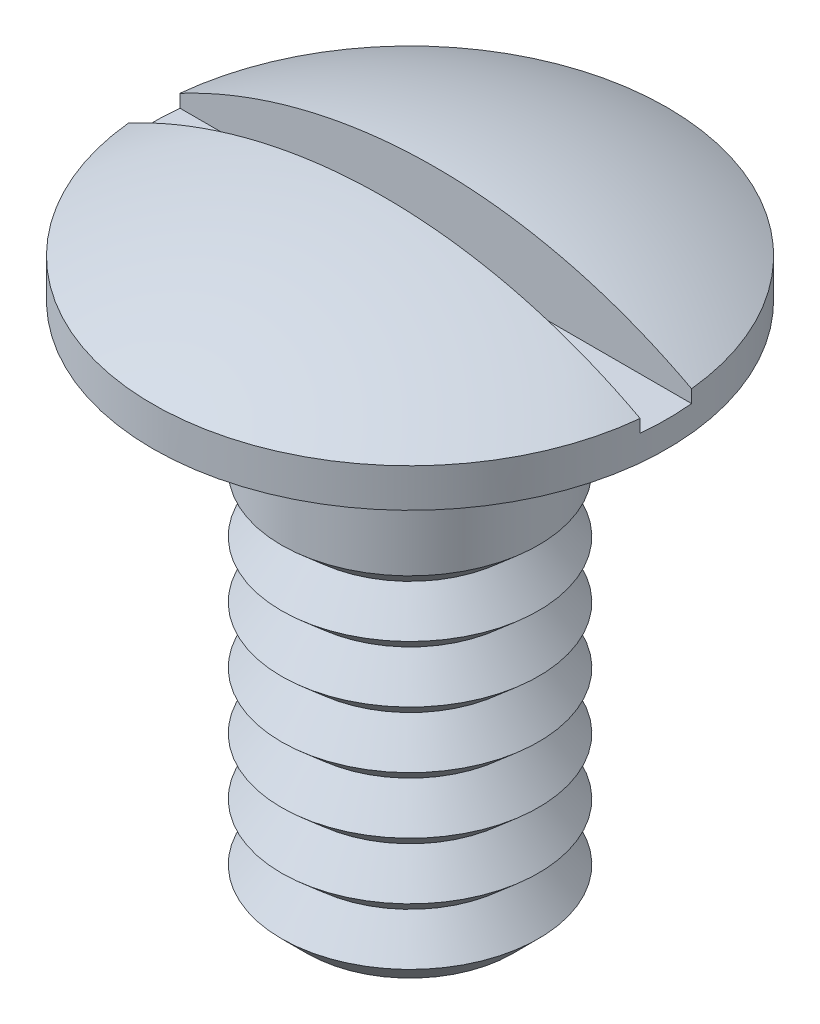
ISO-10303-21;
HEADER;
FILE_DESCRIPTION(('STEP AP214'),'2;1');
FILE_NAME('part.step','',(''),(''),'','','');
FILE_SCHEMA(('AUTOMOTIVE_DESIGN { 1 0 10303 214 1 1 1 1 }'));
ENDSEC;
DATA;
#1=APPLICATION_CONTEXT('core data for automotive mechanical design processes');
#2=APPLICATION_PROTOCOL_DEFINITION('international standard','automotive_design',2000,#1);
#3=PRODUCT_CONTEXT('',#1,'mechanical');
#4=PRODUCT('Part','Part','',(#3));
#5=PRODUCT_RELATED_PRODUCT_CATEGORY('part','',(#4));
#6=PRODUCT_DEFINITION_FORMATION('','',#4);
#7=PRODUCT_DEFINITION_CONTEXT('part definition',#1,'design');
#8=PRODUCT_DEFINITION('design','',#6,#7);
#9=PRODUCT_DEFINITION_SHAPE('','',#8);
#10=(LENGTH_UNIT() NAMED_UNIT(*) SI_UNIT(.MILLI.,.METRE.));
#11=(NAMED_UNIT(*) PLANE_ANGLE_UNIT() SI_UNIT($,.RADIAN.));
#12=(NAMED_UNIT(*) SI_UNIT($,.STERADIAN.) SOLID_ANGLE_UNIT());
#13=UNCERTAINTY_MEASURE_WITH_UNIT(LENGTH_MEASURE(1.E-05),#10,'distance_accuracy_value','');
#14=(GEOMETRIC_REPRESENTATION_CONTEXT(3) GLOBAL_UNCERTAINTY_ASSIGNED_CONTEXT((#13)) GLOBAL_UNIT_ASSIGNED_CONTEXT((#10,
#11,#12)) REPRESENTATION_CONTEXT('',''));
#15=CARTESIAN_POINT('',(0.,0.,0.));
#16=DIRECTION('',(0.,0.,1.));
#17=DIRECTION('',(1.,0.,0.));
#18=AXIS2_PLACEMENT_3D('',#15,#16,#17);
#19=CARTESIAN_POINT('',(0.,0.275000000000002,0.));
#20=DIRECTION('',(0.,-1.,0.));
#21=DIRECTION('',(0.,0.,-1.));
#22=AXIS2_PLACEMENT_3D('',#19,#20,#21);
#23=SPHERICAL_SURFACE('',#22,2.125);
#24=CARTESIAN_POINT('',(0.,2.15,0.));
#25=DIRECTION('',(0.,-1.,0.));
#26=DIRECTION('',(0.,0.,-1.));
#27=AXIS2_PLACEMENT_3D('',#24,#25,#26);
#28=CIRCLE('',#27,1.);
#29=CARTESIAN_POINT('',(-0.99498743710662,2.15,-0.0999999999999996));
#30=VERTEX_POINT('',#29);
#31=CARTESIAN_POINT('',(0.994987437106619,2.15,-0.1));
#32=VERTEX_POINT('',#31);
#33=EDGE_CURVE('E108',#30,#32,#28,.T.);
#34=ORIENTED_EDGE('',*,*,#33,.F.);
#35=CARTESIAN_POINT('',(0.,0.275000000000002,-0.1));
#36=DIRECTION('',(0.,0.,-1.));
#37=DIRECTION('',(-1.,0.,0.));
#38=AXIS2_PLACEMENT_3D('',#35,#36,#37);
#39=CIRCLE('',#38,2.12264575471273);
#40=EDGE_CURVE('E110',#30,#32,#39,.T.);
#41=ORIENTED_EDGE('',*,*,#40,.T.);
#42=EDGE_LOOP('',(#34,#41));
#43=FACE_BOUND('',#42,.T.);
#44=ADVANCED_FACE('F41',(#43),#23,.T.);
#45=CARTESIAN_POINT('',(0.99498743710662,2.15,0.1));
#46=VERTEX_POINT('',#45);
#47=CARTESIAN_POINT('',(-0.994987437106619,2.15,0.1));
#48=VERTEX_POINT('',#47);
#49=EDGE_CURVE('E103',#46,#48,#28,.T.);
#50=ORIENTED_EDGE('',*,*,#49,.F.);
#51=CARTESIAN_POINT('',(0.,0.275000000000002,0.1));
#52=DIRECTION('',(0.,0.,1.));
#53=DIRECTION('',(1.,0.,0.));
#54=AXIS2_PLACEMENT_3D('',#51,#52,#53);
#55=CIRCLE('',#54,2.12264575471273);
#56=EDGE_CURVE('E56',#46,#48,#55,.T.);
#57=ORIENTED_EDGE('',*,*,#56,.T.);
#58=EDGE_LOOP('',(#50,#57));
#59=FACE_BOUND('',#58,.T.);
#60=ADVANCED_FACE('F136',(#59),#23,.T.);
#61=CARTESIAN_POINT('',(0.,0.,0.));
#62=DIRECTION('',(0.,-1.,0.));
#63=DIRECTION('',(0.,0.,-1.));
#64=AXIS2_PLACEMENT_3D('',#61,#62,#63);
#65=CYLINDRICAL_SURFACE('',#64,1.);
#66=CARTESIAN_POINT('',(0.,2.,0.));
#67=DIRECTION('',(0.,-1.,0.));
#68=DIRECTION('',(0.,0.,-1.));
#69=AXIS2_PLACEMENT_3D('',#66,#67,#68);
#70=CIRCLE('',#69,1.);
#71=CARTESIAN_POINT('',(0.,2.,-0.999999999999999));
#72=VERTEX_POINT('',#71);
#73=EDGE_CURVE('E111',#72,#72,#70,.T.);
#74=ORIENTED_EDGE('',*,*,#73,.F.);
#75=EDGE_LOOP('',(#74));
#76=FACE_BOUND('',#75,.T.);
#77=CARTESIAN_POINT('',(0.,2.1,0.));
#78=DIRECTION('',(0.,-1.,0.));
#79=DIRECTION('',(0.,0.,-1.));
#80=AXIS2_PLACEMENT_3D('',#77,#78,#79);
#81=CIRCLE('',#80,1.);
#82=CARTESIAN_POINT('',(-0.99498743710662,2.1,0.1));
#83=VERTEX_POINT('',#82);
#84=CARTESIAN_POINT('',(-0.99498743710662,2.1,-0.1));
#85=VERTEX_POINT('',#84);
#86=EDGE_CURVE('E84',#83,#85,#81,.T.);
#87=ORIENTED_EDGE('',*,*,#86,.T.);
#88=DIRECTION('',(0.,-1.,0.));
#89=VECTOR('',#88,1.);
#90=CARTESIAN_POINT('',(-0.99498743710662,0.,-0.1));
#91=LINE('',#90,#89);
#92=EDGE_CURVE('E49',#85,#30,#91,.F.);
#93=ORIENTED_EDGE('',*,*,#92,.T.);
#94=ORIENTED_EDGE('',*,*,#33,.T.);
#95=DIRECTION('',(0.,-1.,0.));
#96=VECTOR('',#95,1.);
#97=CARTESIAN_POINT('',(0.99498743710662,0.,-0.1));
#98=LINE('',#97,#96);
#99=CARTESIAN_POINT('',(0.99498743710662,2.1,-0.1));
#100=VERTEX_POINT('',#99);
#101=EDGE_CURVE('E64',#32,#100,#98,.T.);
#102=ORIENTED_EDGE('',*,*,#101,.T.);
#103=CARTESIAN_POINT('',(0.99498743710662,2.1,0.1));
#104=VERTEX_POINT('',#103);
#105=EDGE_CURVE('E95',#100,#104,#81,.T.);
#106=ORIENTED_EDGE('',*,*,#105,.T.);
#107=DIRECTION('',(0.,-1.,0.));
#108=VECTOR('',#107,1.);
#109=CARTESIAN_POINT('',(0.99498743710662,0.,0.1));
#110=LINE('',#109,#108);
#111=EDGE_CURVE('E97',#104,#46,#110,.F.);
#112=ORIENTED_EDGE('',*,*,#111,.T.);
#113=ORIENTED_EDGE('',*,*,#49,.T.);
#114=DIRECTION('',(0.,-1.,0.));
#115=VECTOR('',#114,1.);
#116=CARTESIAN_POINT('',(-0.99498743710662,0.,0.1));
#117=LINE('',#116,#115);
#118=EDGE_CURVE('E93',#48,#83,#117,.T.);
#119=ORIENTED_EDGE('',*,*,#118,.T.);
#120=EDGE_LOOP('',(#87,#93,#94,#102,#106,#112,#113,#119));
#121=FACE_BOUND('',#120,.T.);
#122=ADVANCED_FACE('F101',(#76,#121),#65,.T.);
#123=CARTESIAN_POINT('',(0.,2.,0.5));
#124=DIRECTION('',(0.,1.,0.));
#125=DIRECTION('',(0.,0.,1.));
#126=AXIS2_PLACEMENT_3D('',#123,#124,#125);
#127=PLANE('',#126);
#128=CARTESIAN_POINT('',(0.,2.,0.));
#129=DIRECTION('',(0.,-1.,0.));
#130=DIRECTION('',(0.,0.,-1.));
#131=AXIS2_PLACEMENT_3D('',#128,#129,#130);
#132=CIRCLE('',#131,0.5);
#133=CARTESIAN_POINT('',(0.,2.,-0.499999999999999));
#134=VERTEX_POINT('',#133);
#135=EDGE_CURVE('E114',#134,#134,#132,.T.);
#136=ORIENTED_EDGE('',*,*,#135,.F.);
#137=EDGE_LOOP('',(#136));
#138=FACE_BOUND('',#137,.T.);
#139=ORIENTED_EDGE('',*,*,#73,.T.);
#140=EDGE_LOOP('',(#139));
#141=FACE_BOUND('',#140,.T.);
#142=ADVANCED_FACE('F129',(#138,#141),#127,.F.);
#143=CARTESIAN_POINT('',(0.,0.,0.));
#144=DIRECTION('',(0.,-1.,0.));
#145=DIRECTION('',(0.,0.,-1.));
#146=AXIS2_PLACEMENT_3D('',#143,#144,#145);
#147=CYLINDRICAL_SURFACE('',#146,0.5);
#148=CARTESIAN_POINT('',(0.,1.42562968245046,0.));
#149=DIRECTION('',(0.,1.,0.));
#150=DIRECTION('',(0.,0.,1.));
#151=AXIS2_PLACEMENT_3D('',#148,#149,#150);
#152=CIRCLE('',#151,0.5);
#153=CARTESIAN_POINT('',(0.,1.42562968245046,0.5));
#154=VERTEX_POINT('',#153);
#155=EDGE_CURVE('E98',#154,#154,#152,.T.);
#156=ORIENTED_EDGE('',*,*,#155,.T.);
#157=EDGE_LOOP('',(#156));
#158=FACE_BOUND('',#157,.T.);
#159=ORIENTED_EDGE('',*,*,#135,.T.);
#160=EDGE_LOOP('',(#159));
#161=FACE_BOUND('',#160,.T.);
#162=ADVANCED_FACE('F127',(#158,#161),#147,.T.);
#163=CARTESIAN_POINT('',(-1.5,2.7,-0.1));
#164=DIRECTION('',(0.,0.,-1.));
#165=DIRECTION('',(-1.,0.,0.));
#166=AXIS2_PLACEMENT_3D('',#163,#164,#165);
#167=PLANE('',#166);
#168=ORIENTED_EDGE('',*,*,#40,.F.);
#169=ORIENTED_EDGE('',*,*,#92,.F.);
#170=DIRECTION('',(1.,0.,0.));
#171=VECTOR('',#170,1.);
#172=CARTESIAN_POINT('',(-1.5,2.1,-0.1));
#173=LINE('',#172,#171);
#174=EDGE_CURVE('E89',#85,#100,#173,.T.);
#175=ORIENTED_EDGE('',*,*,#174,.T.);
#176=ORIENTED_EDGE('',*,*,#101,.F.);
#177=EDGE_LOOP('',(#168,#169,#175,#176));
#178=FACE_BOUND('',#177,.T.);
#179=ADVANCED_FACE('F118',(#178),#167,.F.);
#180=CARTESIAN_POINT('',(-1.5,2.1,0.1));
#181=DIRECTION('',(0.,-1.,0.));
#182=DIRECTION('',(0.,0.,-1.));
#183=AXIS2_PLACEMENT_3D('',#180,#181,#182);
#184=PLANE('',#183);
#185=ORIENTED_EDGE('',*,*,#174,.F.);
#186=ORIENTED_EDGE('',*,*,#86,.F.);
#187=DIRECTION('',(1.,0.,0.));
#188=VECTOR('',#187,1.);
#189=CARTESIAN_POINT('',(-1.5,2.1,0.1));
#190=LINE('',#189,#188);
#191=EDGE_CURVE('E87',#83,#104,#190,.T.);
#192=ORIENTED_EDGE('',*,*,#191,.T.);
#193=ORIENTED_EDGE('',*,*,#105,.F.);
#194=EDGE_LOOP('',(#185,#186,#192,#193));
#195=FACE_BOUND('',#194,.T.);
#196=ADVANCED_FACE('F86',(#195),#184,.F.);
#197=CARTESIAN_POINT('',(-1.5,2.7,0.1));
#198=DIRECTION('',(0.,0.,1.));
#199=DIRECTION('',(1.,0.,0.));
#200=AXIS2_PLACEMENT_3D('',#197,#198,#199);
#201=PLANE('',#200);
#202=ORIENTED_EDGE('',*,*,#56,.F.);
#203=ORIENTED_EDGE('',*,*,#111,.F.);
#204=ORIENTED_EDGE('',*,*,#191,.F.);
#205=ORIENTED_EDGE('',*,*,#118,.F.);
#206=EDGE_LOOP('',(#202,#203,#204,#205));
#207=FACE_BOUND('',#206,.T.);
#208=ADVANCED_FACE('F96',(#207),#201,.F.);
#209=CARTESIAN_POINT('',(0.,1.3296110358079,0.));
#210=DIRECTION('',(0.,1.,0.));
#211=DIRECTION('',(0.,0.,1.));
#212=AXIS2_PLACEMENT_3D('',#209,#210,#211);
#213=CONICAL_SURFACE('',#212,0.390480074081101,0.850991257067413);
#214=ORIENTED_EDGE('',*,*,#155,.F.);
#215=EDGE_LOOP('',(#214));
#216=FACE_BOUND('',#215,.T.);
#217=CARTESIAN_POINT('',(0.,1.3296110358079,0.));
#218=DIRECTION('',(0.,1.,0.));
#219=DIRECTION('',(0.,0.,1.));
#220=AXIS2_PLACEMENT_3D('',#217,#218,#219);
#221=CIRCLE('',#220,0.390480074081101);
#222=CARTESIAN_POINT('',(0.,1.3296110358079,0.390480074081101));
#223=VERTEX_POINT('',#222);
#224=EDGE_CURVE('E366',#223,#223,#221,.T.);
#225=ORIENTED_EDGE('',*,*,#224,.T.);
#226=EDGE_LOOP('',(#225));
#227=FACE_BOUND('',#226,.T.);
#228=ADVANCED_FACE('F181',(#216,#227),#213,.T.);
#229=CARTESIAN_POINT('',(0.,1.20469140204205,0.));
#230=DIRECTION('',(0.,-1.,0.));
#231=DIRECTION('',(0.,0.,-1.));
#232=AXIS2_PLACEMENT_3D('',#229,#230,#231);
#233=CONICAL_SURFACE('',#232,0.5,0.719805069727485);
#234=ORIENTED_EDGE('',*,*,#224,.F.);
#235=EDGE_LOOP('',(#234));
#236=FACE_BOUND('',#235,.T.);
#237=CARTESIAN_POINT('',(0.,1.20469140204205,0.));
#238=DIRECTION('',(0.,1.,0.));
#239=DIRECTION('',(0.,0.,1.));
#240=AXIS2_PLACEMENT_3D('',#237,#238,#239);
#241=CIRCLE('',#240,0.5);
#242=CARTESIAN_POINT('',(0.,1.20469140204205,0.5));
#243=VERTEX_POINT('',#242);
#244=EDGE_CURVE('E364',#243,#243,#241,.T.);
#245=ORIENTED_EDGE('',*,*,#244,.T.);
#246=EDGE_LOOP('',(#245));
#247=FACE_BOUND('',#246,.T.);
#248=ADVANCED_FACE('F218',(#236,#247),#233,.T.);
#249=CARTESIAN_POINT('',(0.,1.10867275539949,0.));
#250=DIRECTION('',(0.,1.,0.));
#251=DIRECTION('',(0.,0.,1.));
#252=AXIS2_PLACEMENT_3D('',#249,#250,#251);
#253=CONICAL_SURFACE('',#252,0.390480074081101,0.850991257067414);
#254=ORIENTED_EDGE('',*,*,#244,.F.);
#255=EDGE_LOOP('',(#254));
#256=FACE_BOUND('',#255,.T.);
#257=CARTESIAN_POINT('',(0.,1.10867275539949,0.));
#258=DIRECTION('',(0.,1.,0.));
#259=DIRECTION('',(0.,0.,1.));
#260=AXIS2_PLACEMENT_3D('',#257,#258,#259);
#261=CIRCLE('',#260,0.390480074081101);
#262=CARTESIAN_POINT('',(0.,1.10867275539949,0.390480074081101));
#263=VERTEX_POINT('',#262);
#264=EDGE_CURVE('E361',#263,#263,#261,.T.);
#265=ORIENTED_EDGE('',*,*,#264,.T.);
#266=EDGE_LOOP('',(#265));
#267=FACE_BOUND('',#266,.T.);
#268=ADVANCED_FACE('F228',(#256,#267),#253,.T.);
#269=CARTESIAN_POINT('',(0.,0.983753121633636,0.));
#270=DIRECTION('',(0.,-1.,0.));
#271=DIRECTION('',(0.,0.,-1.));
#272=AXIS2_PLACEMENT_3D('',#269,#270,#271);
#273=CONICAL_SURFACE('',#272,0.5,0.719805069727485);
#274=ORIENTED_EDGE('',*,*,#264,.F.);
#275=EDGE_LOOP('',(#274));
#276=FACE_BOUND('',#275,.T.);
#277=CARTESIAN_POINT('',(0.,0.983753121633636,0.));
#278=DIRECTION('',(0.,1.,0.));
#279=DIRECTION('',(0.,0.,1.));
#280=AXIS2_PLACEMENT_3D('',#277,#278,#279);
#281=CIRCLE('',#280,0.5);
#282=CARTESIAN_POINT('',(0.,0.983753121633636,0.5));
#283=VERTEX_POINT('',#282);
#284=EDGE_CURVE('E358',#283,#283,#281,.T.);
#285=ORIENTED_EDGE('',*,*,#284,.T.);
#286=EDGE_LOOP('',(#285));
#287=FACE_BOUND('',#286,.T.);
#288=ADVANCED_FACE('F238',(#276,#287),#273,.T.);
#289=CARTESIAN_POINT('',(0.,0.887734474991081,0.));
#290=DIRECTION('',(0.,1.,0.));
#291=DIRECTION('',(0.,0.,1.));
#292=AXIS2_PLACEMENT_3D('',#289,#290,#291);
#293=CONICAL_SURFACE('',#292,0.390480074081101,0.850991257067412);
#294=ORIENTED_EDGE('',*,*,#284,.F.);
#295=EDGE_LOOP('',(#294));
#296=FACE_BOUND('',#295,.T.);
#297=CARTESIAN_POINT('',(0.,0.887734474991081,0.));
#298=DIRECTION('',(0.,1.,0.));
#299=DIRECTION('',(0.,0.,1.));
#300=AXIS2_PLACEMENT_3D('',#297,#298,#299);
#301=CIRCLE('',#300,0.390480074081101);
#302=CARTESIAN_POINT('',(0.,0.887734474991081,0.390480074081102));
#303=VERTEX_POINT('',#302);
#304=EDGE_CURVE('E355',#303,#303,#301,.T.);
#305=ORIENTED_EDGE('',*,*,#304,.T.);
#306=EDGE_LOOP('',(#305));
#307=FACE_BOUND('',#306,.T.);
#308=ADVANCED_FACE('F248',(#296,#307),#293,.T.);
#309=CARTESIAN_POINT('',(0.,0.762814841225227,0.));
#310=DIRECTION('',(0.,-1.,0.));
#311=DIRECTION('',(0.,0.,-1.));
#312=AXIS2_PLACEMENT_3D('',#309,#310,#311);
#313=CONICAL_SURFACE('',#312,0.5,0.719805069727486);
#314=ORIENTED_EDGE('',*,*,#304,.F.);
#315=EDGE_LOOP('',(#314));
#316=FACE_BOUND('',#315,.T.);
#317=CARTESIAN_POINT('',(0.,0.762814841225227,0.));
#318=DIRECTION('',(0.,1.,0.));
#319=DIRECTION('',(0.,0.,1.));
#320=AXIS2_PLACEMENT_3D('',#317,#318,#319);
#321=CIRCLE('',#320,0.5);
#322=CARTESIAN_POINT('',(0.,0.762814841225227,0.5));
#323=VERTEX_POINT('',#322);
#324=EDGE_CURVE('E352',#323,#323,#321,.T.);
#325=ORIENTED_EDGE('',*,*,#324,.T.);
#326=EDGE_LOOP('',(#325));
#327=FACE_BOUND('',#326,.T.);
#328=ADVANCED_FACE('F258',(#316,#327),#313,.T.);
#329=CARTESIAN_POINT('',(0.,0.666796194582671,0.));
#330=DIRECTION('',(0.,1.,0.));
#331=DIRECTION('',(0.,0.,1.));
#332=AXIS2_PLACEMENT_3D('',#329,#330,#331);
#333=CONICAL_SURFACE('',#332,0.390480074081102,0.850991257067411);
#334=ORIENTED_EDGE('',*,*,#324,.F.);
#335=EDGE_LOOP('',(#334));
#336=FACE_BOUND('',#335,.T.);
#337=CARTESIAN_POINT('',(0.,0.666796194582671,0.));
#338=DIRECTION('',(0.,1.,0.));
#339=DIRECTION('',(0.,0.,1.));
#340=AXIS2_PLACEMENT_3D('',#337,#338,#339);
#341=CIRCLE('',#340,0.390480074081102);
#342=CARTESIAN_POINT('',(0.,0.666796194582671,0.390480074081102));
#343=VERTEX_POINT('',#342);
#344=EDGE_CURVE('E349',#343,#343,#341,.T.);
#345=ORIENTED_EDGE('',*,*,#344,.T.);
#346=EDGE_LOOP('',(#345));
#347=FACE_BOUND('',#346,.T.);
#348=ADVANCED_FACE('F268',(#336,#347),#333,.T.);
#349=CARTESIAN_POINT('',(0.,0.541876560816817,0.));
#350=DIRECTION('',(0.,-1.,0.));
#351=DIRECTION('',(0.,0.,-1.));
#352=AXIS2_PLACEMENT_3D('',#349,#350,#351);
#353=CONICAL_SURFACE('',#352,0.5,0.719805069727484);
#354=ORIENTED_EDGE('',*,*,#344,.F.);
#355=EDGE_LOOP('',(#354));
#356=FACE_BOUND('',#355,.T.);
#357=CARTESIAN_POINT('',(0.,0.541876560816817,0.));
#358=DIRECTION('',(0.,1.,0.));
#359=DIRECTION('',(0.,0.,1.));
#360=AXIS2_PLACEMENT_3D('',#357,#358,#359);
#361=CIRCLE('',#360,0.5);
#362=CARTESIAN_POINT('',(0.,0.541876560816817,0.5));
#363=VERTEX_POINT('',#362);
#364=EDGE_CURVE('E346',#363,#363,#361,.T.);
#365=ORIENTED_EDGE('',*,*,#364,.T.);
#366=EDGE_LOOP('',(#365));
#367=FACE_BOUND('',#366,.T.);
#368=ADVANCED_FACE('F278',(#356,#367),#353,.T.);
#369=CARTESIAN_POINT('',(0.,0.445857914174262,0.));
#370=DIRECTION('',(0.,1.,0.));
#371=DIRECTION('',(0.,0.,1.));
#372=AXIS2_PLACEMENT_3D('',#369,#370,#371);
#373=CONICAL_SURFACE('',#372,0.390480074081102,0.850991257067412);
#374=ORIENTED_EDGE('',*,*,#364,.F.);
#375=EDGE_LOOP('',(#374));
#376=FACE_BOUND('',#375,.T.);
#377=CARTESIAN_POINT('',(0.,0.445857914174262,0.));
#378=DIRECTION('',(0.,1.,0.));
#379=DIRECTION('',(0.,0.,1.));
#380=AXIS2_PLACEMENT_3D('',#377,#378,#379);
#381=CIRCLE('',#380,0.390480074081102);
#382=CARTESIAN_POINT('',(0.,0.445857914174262,0.390480074081102));
#383=VERTEX_POINT('',#382);
#384=EDGE_CURVE('E343',#383,#383,#381,.T.);
#385=ORIENTED_EDGE('',*,*,#384,.T.);
#386=EDGE_LOOP('',(#385));
#387=FACE_BOUND('',#386,.T.);
#388=ADVANCED_FACE('F288',(#376,#387),#373,.T.);
#389=CARTESIAN_POINT('',(0.,0.320938280408408,0.));
#390=DIRECTION('',(0.,-1.,0.));
#391=DIRECTION('',(0.,0.,-1.));
#392=AXIS2_PLACEMENT_3D('',#389,#390,#391);
#393=CONICAL_SURFACE('',#392,0.5,0.719805069727486);
#394=ORIENTED_EDGE('',*,*,#384,.F.);
#395=EDGE_LOOP('',(#394));
#396=FACE_BOUND('',#395,.T.);
#397=CARTESIAN_POINT('',(0.,0.320938280408408,0.));
#398=DIRECTION('',(0.,1.,0.));
#399=DIRECTION('',(0.,0.,1.));
#400=AXIS2_PLACEMENT_3D('',#397,#398,#399);
#401=CIRCLE('',#400,0.5);
#402=CARTESIAN_POINT('',(0.,0.320938280408408,0.5));
#403=VERTEX_POINT('',#402);
#404=EDGE_CURVE('E338',#403,#403,#401,.T.);
#405=ORIENTED_EDGE('',*,*,#404,.T.);
#406=EDGE_LOOP('',(#405));
#407=FACE_BOUND('',#406,.T.);
#408=ADVANCED_FACE('F298',(#396,#407),#393,.T.);
#409=CARTESIAN_POINT('',(0.,0.224919633765853,0.));
#410=DIRECTION('',(0.,1.,0.));
#411=DIRECTION('',(0.,0.,1.));
#412=AXIS2_PLACEMENT_3D('',#409,#410,#411);
#413=CONICAL_SURFACE('',#412,0.390480074081102,0.850991257067412);
#414=ORIENTED_EDGE('',*,*,#404,.F.);
#415=EDGE_LOOP('',(#414));
#416=FACE_BOUND('',#415,.T.);
#417=CARTESIAN_POINT('',(0.,0.224919633765853,0.));
#418=DIRECTION('',(0.,1.,0.));
#419=DIRECTION('',(0.,0.,1.));
#420=AXIS2_PLACEMENT_3D('',#417,#418,#419);
#421=CIRCLE('',#420,0.390480074081102);
#422=CARTESIAN_POINT('',(0.,0.224919633765853,0.390480074081102));
#423=VERTEX_POINT('',#422);
#424=EDGE_CURVE('E333',#423,#423,#421,.T.);
#425=ORIENTED_EDGE('',*,*,#424,.T.);
#426=EDGE_LOOP('',(#425));
#427=FACE_BOUND('',#426,.T.);
#428=ADVANCED_FACE('F308',(#416,#427),#413,.T.);
#429=CARTESIAN_POINT('',(0.,0.1,0.));
#430=DIRECTION('',(0.,-1.,0.));
#431=DIRECTION('',(0.,0.,-1.));
#432=AXIS2_PLACEMENT_3D('',#429,#430,#431);
#433=CONICAL_SURFACE('',#432,0.5,0.719805069727486);
#434=ORIENTED_EDGE('',*,*,#424,.F.);
#435=EDGE_LOOP('',(#434));
#436=FACE_BOUND('',#435,.T.);
#437=CARTESIAN_POINT('',(0.,0.1,0.));
#438=DIRECTION('',(0.,1.,0.));
#439=DIRECTION('',(0.,0.,1.));
#440=AXIS2_PLACEMENT_3D('',#437,#438,#439);
#441=CIRCLE('',#440,0.5);
#442=CARTESIAN_POINT('',(0.,0.1,0.5));
#443=VERTEX_POINT('',#442);
#444=EDGE_CURVE('E336',#443,#443,#441,.T.);
#445=ORIENTED_EDGE('',*,*,#444,.T.);
#446=EDGE_LOOP('',(#445));
#447=FACE_BOUND('',#446,.T.);
#448=ADVANCED_FACE('F193',(#436,#447),#433,.T.);
#449=CARTESIAN_POINT('',(0.,0.,0.));
#450=DIRECTION('',(0.,1.,0.));
#451=DIRECTION('',(0.,0.,1.));
#452=AXIS2_PLACEMENT_3D('',#449,#450,#451);
#453=PLANE('',#452);
#454=CARTESIAN_POINT('',(0.,0.,0.));
#455=DIRECTION('',(0.,1.,0.));
#456=DIRECTION('',(0.,0.,1.));
#457=AXIS2_PLACEMENT_3D('',#454,#455,#456);
#458=CIRCLE('',#457,0.4);
#459=CARTESIAN_POINT('',(0.,0.,0.4));
#460=VERTEX_POINT('',#459);
#461=EDGE_CURVE('E11',#460,#460,#458,.F.);
#462=ORIENTED_EDGE('',*,*,#461,.T.);
#463=EDGE_LOOP('',(#462));
#464=FACE_BOUND('',#463,.T.);
#465=ADVANCED_FACE('F188',(#464),#453,.F.);
#466=CARTESIAN_POINT('',(0.,0.,0.));
#467=DIRECTION('',(0.,1.,0.));
#468=DIRECTION('',(0.,0.,1.));
#469=AXIS2_PLACEMENT_3D('',#466,#467,#468);
#470=CONICAL_SURFACE('',#469,0.4,0.785398163397447);
#471=ORIENTED_EDGE('',*,*,#444,.F.);
#472=EDGE_LOOP('',(#471));
#473=FACE_BOUND('',#472,.T.);
#474=ORIENTED_EDGE('',*,*,#461,.F.);
#475=EDGE_LOOP('',(#474));
#476=FACE_BOUND('',#475,.T.);
#477=ADVANCED_FACE('F43',(#473,#476),#470,.T.);
#478=CLOSED_SHELL('',(#44,#60,#122,#142,#162,#179,#196,#208,#228,#248,#268,#288,#308,#328,#348,
#368,#388,#408,#428,#448,#465,#477));
#479=MANIFOLD_SOLID_BREP('B2',#478);
#480=ADVANCED_BREP_SHAPE_REPRESENTATION('',(#18,#479),#14);
#481=SHAPE_DEFINITION_REPRESENTATION(#9,#480);
ENDSEC;
END-ISO-10303-21;
